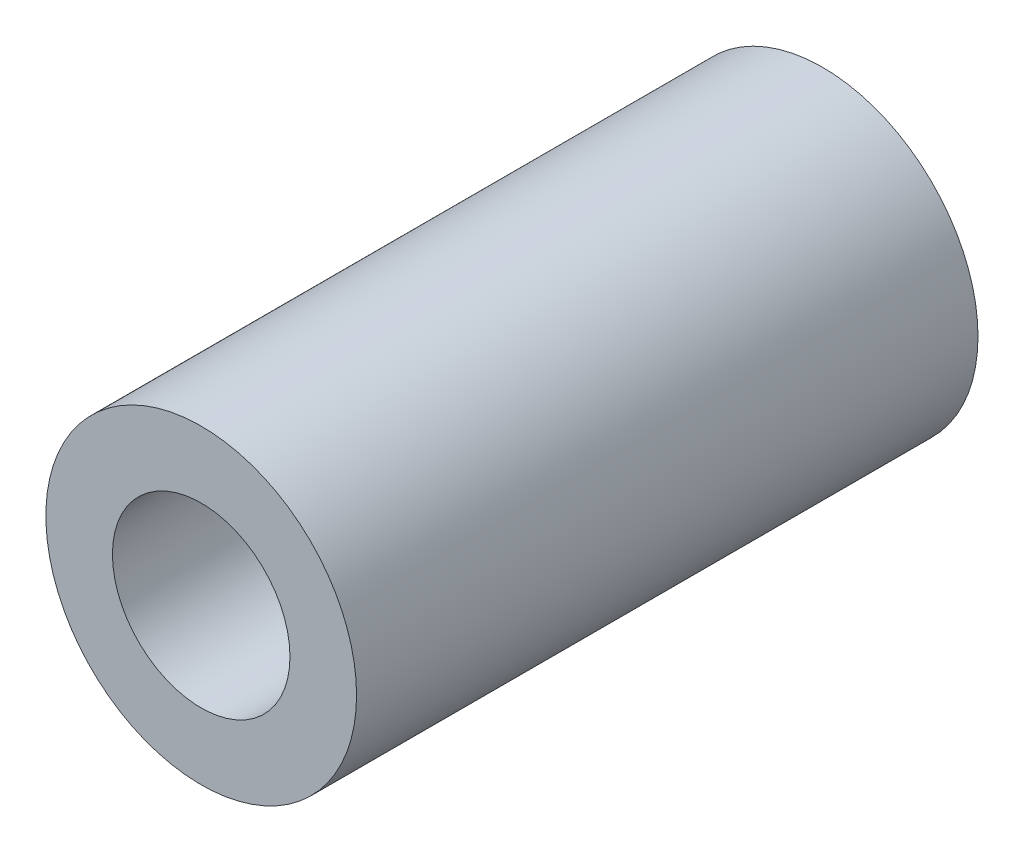
ISO-10303-21;
HEADER;
FILE_DESCRIPTION(('STEP AP214'),'2;1');
FILE_NAME('part.step','',(''),(''),'','','');
FILE_SCHEMA(('AUTOMOTIVE_DESIGN { 1 0 10303 214 1 1 1 1 }'));
ENDSEC;
DATA;
#1=APPLICATION_CONTEXT('core data for automotive mechanical design processes');
#2=APPLICATION_PROTOCOL_DEFINITION('international standard','automotive_design',2000,#1);
#3=PRODUCT_CONTEXT('',#1,'mechanical');
#4=PRODUCT('Part','Part','',(#3));
#5=PRODUCT_RELATED_PRODUCT_CATEGORY('part','',(#4));
#6=PRODUCT_DEFINITION_FORMATION('','',#4);
#7=PRODUCT_DEFINITION_CONTEXT('part definition',#1,'design');
#8=PRODUCT_DEFINITION('design','',#6,#7);
#9=PRODUCT_DEFINITION_SHAPE('','',#8);
#10=(LENGTH_UNIT() NAMED_UNIT(*) SI_UNIT(.MILLI.,.METRE.));
#11=(NAMED_UNIT(*) PLANE_ANGLE_UNIT() SI_UNIT($,.RADIAN.));
#12=(NAMED_UNIT(*) SI_UNIT($,.STERADIAN.) SOLID_ANGLE_UNIT());
#13=UNCERTAINTY_MEASURE_WITH_UNIT(LENGTH_MEASURE(1.E-05),#10,'distance_accuracy_value','');
#14=(GEOMETRIC_REPRESENTATION_CONTEXT(3) GLOBAL_UNCERTAINTY_ASSIGNED_CONTEXT((#13)) GLOBAL_UNIT_ASSIGNED_CONTEXT((#10,
#11,#12)) REPRESENTATION_CONTEXT('',''));
#15=CARTESIAN_POINT('',(0.,0.,0.));
#16=DIRECTION('',(0.,0.,1.));
#17=DIRECTION('',(1.,0.,0.));
#18=AXIS2_PLACEMENT_3D('',#15,#16,#17);
#19=CARTESIAN_POINT('',(0.,0.,14.));
#20=DIRECTION('',(0.,0.,1.));
#21=DIRECTION('',(1.,0.,0.));
#22=AXIS2_PLACEMENT_3D('',#19,#20,#21);
#23=PLANE('',#22);
#24=CARTESIAN_POINT('',(0.,0.,14.));
#25=DIRECTION('',(0.,0.,1.));
#26=DIRECTION('',(1.,0.,0.));
#27=AXIS2_PLACEMENT_3D('',#24,#25,#26);
#28=CIRCLE('',#27,7.);
#29=CARTESIAN_POINT('',(7.,0.,14.));
#30=VERTEX_POINT('',#29);
#31=EDGE_CURVE('E10',#30,#30,#28,.T.);
#32=ORIENTED_EDGE('',*,*,#31,.T.);
#33=EDGE_LOOP('',(#32));
#34=FACE_BOUND('',#33,.T.);
#35=CARTESIAN_POINT('',(0.,0.,14.));
#36=DIRECTION('',(0.,0.,1.));
#37=DIRECTION('',(1.,0.,0.));
#38=AXIS2_PLACEMENT_3D('',#35,#36,#37);
#39=CIRCLE('',#38,4.);
#40=CARTESIAN_POINT('',(4.,0.,14.));
#41=VERTEX_POINT('',#40);
#42=EDGE_CURVE('E52',#41,#41,#39,.T.);
#43=ORIENTED_EDGE('',*,*,#42,.F.);
#44=EDGE_LOOP('',(#43));
#45=FACE_BOUND('',#44,.T.);
#46=ADVANCED_FACE('F41',(#34,#45),#23,.T.);
#47=CARTESIAN_POINT('',(0.,0.,-14.));
#48=DIRECTION('',(0.,0.,1.));
#49=DIRECTION('',(1.,0.,0.));
#50=AXIS2_PLACEMENT_3D('',#47,#48,#49);
#51=PLANE('',#50);
#52=CARTESIAN_POINT('',(0.,0.,-14.));
#53=DIRECTION('',(0.,0.,1.));
#54=DIRECTION('',(1.,0.,0.));
#55=AXIS2_PLACEMENT_3D('',#52,#53,#54);
#56=CIRCLE('',#55,7.);
#57=CARTESIAN_POINT('',(7.,0.,-14.));
#58=VERTEX_POINT('',#57);
#59=EDGE_CURVE('E45',#58,#58,#56,.T.);
#60=ORIENTED_EDGE('',*,*,#59,.F.);
#61=EDGE_LOOP('',(#60));
#62=FACE_BOUND('',#61,.T.);
#63=CARTESIAN_POINT('',(0.,0.,-14.));
#64=DIRECTION('',(0.,0.,1.));
#65=DIRECTION('',(1.,0.,0.));
#66=AXIS2_PLACEMENT_3D('',#63,#64,#65);
#67=CIRCLE('',#66,4.);
#68=CARTESIAN_POINT('',(4.,0.,-14.));
#69=VERTEX_POINT('',#68);
#70=EDGE_CURVE('E54',#69,#69,#67,.T.);
#71=ORIENTED_EDGE('',*,*,#70,.T.);
#72=EDGE_LOOP('',(#71));
#73=FACE_BOUND('',#72,.T.);
#74=ADVANCED_FACE('F64',(#62,#73),#51,.F.);
#75=CARTESIAN_POINT('',(0.,0.,14.));
#76=DIRECTION('',(0.,0.,-1.));
#77=DIRECTION('',(-1.,0.,0.));
#78=AXIS2_PLACEMENT_3D('',#75,#76,#77);
#79=CYLINDRICAL_SURFACE('',#78,7.);
#80=ORIENTED_EDGE('',*,*,#31,.F.);
#81=EDGE_LOOP('',(#80));
#82=FACE_BOUND('',#81,.T.);
#83=ORIENTED_EDGE('',*,*,#59,.T.);
#84=EDGE_LOOP('',(#83));
#85=FACE_BOUND('',#84,.T.);
#86=ADVANCED_FACE('F43',(#82,#85),#79,.T.);
#87=CARTESIAN_POINT('',(0.,0.,14.));
#88=DIRECTION('',(0.,0.,-1.));
#89=DIRECTION('',(-1.,0.,0.));
#90=AXIS2_PLACEMENT_3D('',#87,#88,#89);
#91=CYLINDRICAL_SURFACE('',#90,4.);
#92=ORIENTED_EDGE('',*,*,#42,.T.);
#93=EDGE_LOOP('',(#92));
#94=FACE_BOUND('',#93,.T.);
#95=ORIENTED_EDGE('',*,*,#70,.F.);
#96=EDGE_LOOP('',(#95));
#97=FACE_BOUND('',#96,.T.);
#98=ADVANCED_FACE('F60',(#94,#97),#91,.F.);
#99=CLOSED_SHELL('',(#46,#74,#86,#98));
#100=MANIFOLD_SOLID_BREP('B2',#99);
#101=ADVANCED_BREP_SHAPE_REPRESENTATION('',(#18,#100),#14);
#102=SHAPE_DEFINITION_REPRESENTATION(#9,#101);
ENDSEC;
END-ISO-10303-21;
